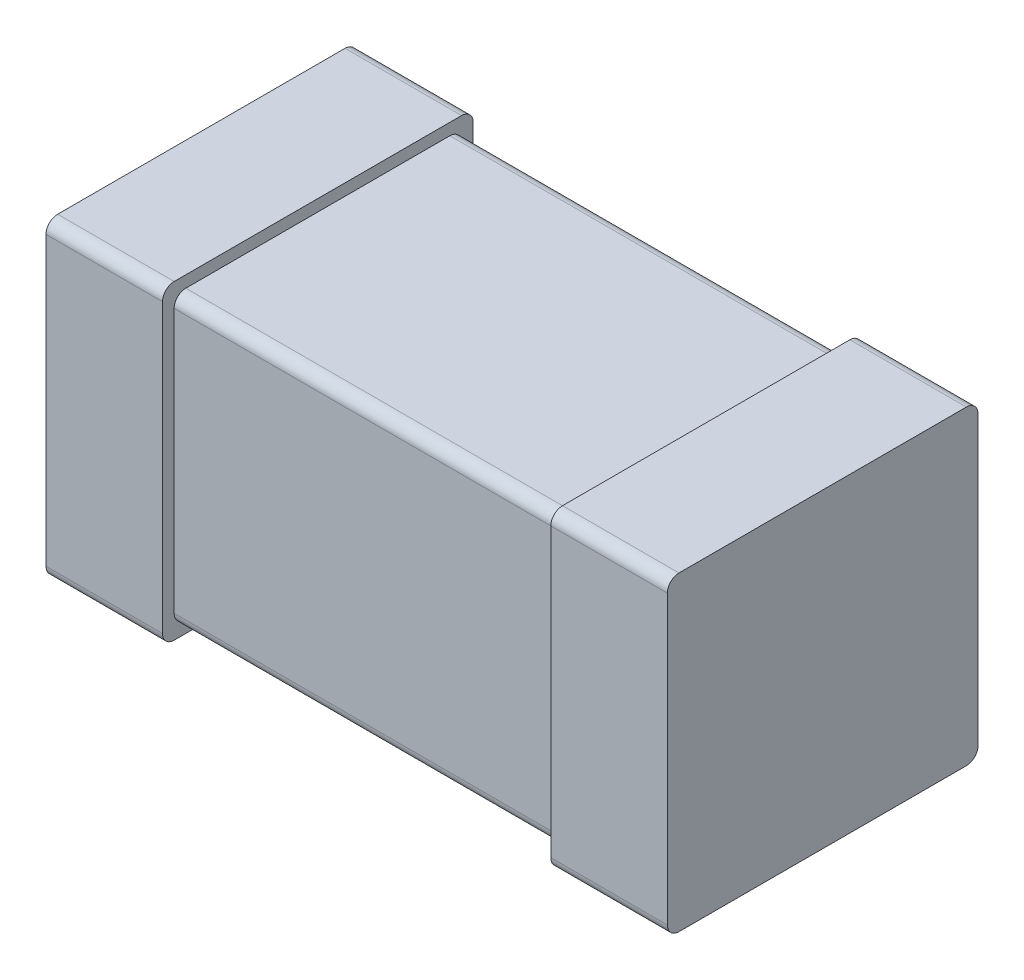
ISO-10303-21;
HEADER;
FILE_DESCRIPTION(('STEP AP214'),'2;1');
FILE_NAME('part.step','',(''),(''),'','','');
FILE_SCHEMA(('AUTOMOTIVE_DESIGN { 1 0 10303 214 1 1 1 1 }'));
ENDSEC;
DATA;
#1=APPLICATION_CONTEXT('core data for automotive mechanical design processes');
#2=APPLICATION_PROTOCOL_DEFINITION('international standard','automotive_design',2000,#1);
#3=PRODUCT_CONTEXT('',#1,'mechanical');
#4=PRODUCT('Part','Part','',(#3));
#5=PRODUCT_RELATED_PRODUCT_CATEGORY('part','',(#4));
#6=PRODUCT_DEFINITION_FORMATION('','',#4);
#7=PRODUCT_DEFINITION_CONTEXT('part definition',#1,'design');
#8=PRODUCT_DEFINITION('design','',#6,#7);
#9=PRODUCT_DEFINITION_SHAPE('','',#8);
#10=(LENGTH_UNIT() NAMED_UNIT(*) SI_UNIT(.MILLI.,.METRE.));
#11=(NAMED_UNIT(*) PLANE_ANGLE_UNIT() SI_UNIT($,.RADIAN.));
#12=(NAMED_UNIT(*) SI_UNIT($,.STERADIAN.) SOLID_ANGLE_UNIT());
#13=UNCERTAINTY_MEASURE_WITH_UNIT(LENGTH_MEASURE(1.E-05),#10,'distance_accuracy_value','');
#14=(GEOMETRIC_REPRESENTATION_CONTEXT(3) GLOBAL_UNCERTAINTY_ASSIGNED_CONTEXT((#13)) GLOBAL_UNIT_ASSIGNED_CONTEXT((#10,
#11,#12)) REPRESENTATION_CONTEXT('',''));
#15=CARTESIAN_POINT('',(0.,0.,0.));
#16=DIRECTION('',(0.,0.,1.));
#17=DIRECTION('',(1.,0.,0.));
#18=AXIS2_PLACEMENT_3D('',#15,#16,#17);
#19=CARTESIAN_POINT('',(194.464744279938,97.4790432923502,112.211582908599));
#20=DIRECTION('',(-1.,0.,0.));
#21=DIRECTION('',(0.,0.,1.));
#22=AXIS2_PLACEMENT_3D('',#19,#20,#21);
#23=PLANE('',#22);
#24=DIRECTION('',(0.,0.,1.));
#25=VECTOR('',#24,1.);
#26=CARTESIAN_POINT('',(194.464744279938,97.4790432923502,112.211582908599));
#27=LINE('',#26,#25);
#28=CARTESIAN_POINT('',(194.464744279938,97.4790432923502,112.241582908599));
#29=VERTEX_POINT('',#28);
#30=CARTESIAN_POINT('',(194.464744279938,97.4790432923502,112.981582908599));
#31=VERTEX_POINT('',#30);
#32=EDGE_CURVE('E67',#29,#31,#27,.T.);
#33=ORIENTED_EDGE('',*,*,#32,.F.);
#34=CARTESIAN_POINT('',(194.464744279938,97.4490432923502,112.241582908599));
#35=DIRECTION('',(-1.,0.,0.));
#36=DIRECTION('',(0.,0.,1.));
#37=AXIS2_PLACEMENT_3D('',#34,#35,#36);
#38=CIRCLE('',#37,0.0300000000000023);
#39=CARTESIAN_POINT('',(194.464744279938,97.4490432923502,112.211582908599));
#40=VERTEX_POINT('',#39);
#41=EDGE_CURVE('E11',#29,#40,#38,.T.);
#42=ORIENTED_EDGE('',*,*,#41,.T.);
#43=DIRECTION('',(0.,-1.,0.));
#44=VECTOR('',#43,1.);
#45=CARTESIAN_POINT('',(194.464744279938,97.4790432923502,112.211582908599));
#46=LINE('',#45,#44);
#47=CARTESIAN_POINT('',(194.464744279938,96.7090432923502,112.211582908599));
#48=VERTEX_POINT('',#47);
#49=EDGE_CURVE('E55',#40,#48,#46,.T.);
#50=ORIENTED_EDGE('',*,*,#49,.T.);
#51=CARTESIAN_POINT('',(194.464744279938,96.7090432923502,112.241582908599));
#52=DIRECTION('',(1.,0.,0.));
#53=DIRECTION('',(0.,0.,1.));
#54=AXIS2_PLACEMENT_3D('',#51,#52,#53);
#55=CIRCLE('',#54,0.0300000000000023);
#56=CARTESIAN_POINT('',(194.464744279938,96.6790432923502,112.241582908599));
#57=VERTEX_POINT('',#56);
#58=EDGE_CURVE('E277',#57,#48,#55,.T.);
#59=ORIENTED_EDGE('',*,*,#58,.F.);
#60=DIRECTION('',(0.,0.,1.));
#61=VECTOR('',#60,1.);
#62=CARTESIAN_POINT('',(194.464744279938,96.6790432923502,112.211582908599));
#63=LINE('',#62,#61);
#64=CARTESIAN_POINT('',(194.464744279938,96.6790432923502,112.981582908599));
#65=VERTEX_POINT('',#64);
#66=EDGE_CURVE('E272',#57,#65,#63,.T.);
#67=ORIENTED_EDGE('',*,*,#66,.T.);
#68=CARTESIAN_POINT('',(194.464744279938,96.7090432923502,112.981582908599));
#69=DIRECTION('',(-1.,0.,0.));
#70=DIRECTION('',(0.,0.,1.));
#71=AXIS2_PLACEMENT_3D('',#68,#69,#70);
#72=CIRCLE('',#71,0.0300000000000023);
#73=CARTESIAN_POINT('',(194.464744279938,96.7090432923502,113.011582908599));
#74=VERTEX_POINT('',#73);
#75=EDGE_CURVE('E262',#65,#74,#72,.T.);
#76=ORIENTED_EDGE('',*,*,#75,.T.);
#77=DIRECTION('',(0.,-1.,0.));
#78=VECTOR('',#77,1.);
#79=CARTESIAN_POINT('',(194.464744279938,97.4790432923502,113.011582908599));
#80=LINE('',#79,#78);
#81=CARTESIAN_POINT('',(194.464744279938,97.4490432923502,113.011582908599));
#82=VERTEX_POINT('',#81);
#83=EDGE_CURVE('E315',#82,#74,#80,.T.);
#84=ORIENTED_EDGE('',*,*,#83,.F.);
#85=CARTESIAN_POINT('',(194.464744279938,97.4490432923502,112.981582908599));
#86=DIRECTION('',(1.,0.,0.));
#87=DIRECTION('',(0.,0.,1.));
#88=AXIS2_PLACEMENT_3D('',#85,#86,#87);
#89=CIRCLE('',#88,0.0300000000000023);
#90=EDGE_CURVE('E343',#31,#82,#89,.T.);
#91=ORIENTED_EDGE('',*,*,#90,.F.);
#92=EDGE_LOOP('',(#33,#42,#50,#59,#67,#76,#84,#91));
#93=FACE_BOUND('',#92,.T.);
#94=ADVANCED_FACE('F44',(#93),#23,.T.);
#95=CARTESIAN_POINT('',(194.764744279938,96.6790432923502,112.211582908599));
#96=DIRECTION('',(0.,-1.,0.));
#97=DIRECTION('',(0.,0.,-1.));
#98=AXIS2_PLACEMENT_3D('',#95,#96,#97);
#99=PLANE('',#98);
#100=ORIENTED_EDGE('',*,*,#66,.F.);
#101=DIRECTION('',(-1.,0.,0.));
#102=VECTOR('',#101,1.);
#103=CARTESIAN_POINT('',(194.764744279938,96.6790432923502,112.241582908599));
#104=LINE('',#103,#102);
#105=CARTESIAN_POINT('',(194.764744279938,96.6790432923502,112.241582908599));
#106=VERTEX_POINT('',#105);
#107=EDGE_CURVE('E450',#106,#57,#104,.T.);
#108=ORIENTED_EDGE('',*,*,#107,.F.);
#109=DIRECTION('',(0.,0.,1.));
#110=VECTOR('',#109,1.);
#111=CARTESIAN_POINT('',(194.764744279938,96.6790432923502,112.211582908599));
#112=LINE('',#111,#110);
#113=CARTESIAN_POINT('',(194.764744279938,96.6790432923502,112.981582908599));
#114=VERTEX_POINT('',#113);
#115=EDGE_CURVE('E273',#106,#114,#112,.T.);
#116=ORIENTED_EDGE('',*,*,#115,.T.);
#117=DIRECTION('',(-1.,0.,0.));
#118=VECTOR('',#117,1.);
#119=CARTESIAN_POINT('',(194.764744279938,96.6790432923502,112.981582908599));
#120=LINE('',#119,#118);
#121=EDGE_CURVE('E267',#114,#65,#120,.T.);
#122=ORIENTED_EDGE('',*,*,#121,.T.);
#123=EDGE_LOOP('',(#100,#108,#116,#122));
#124=FACE_BOUND('',#123,.T.);
#125=ADVANCED_FACE('F283',(#124),#99,.T.);
#126=CARTESIAN_POINT('',(194.764744279938,96.7090432923502,112.981582908599));
#127=DIRECTION('',(-1.,0.,0.));
#128=DIRECTION('',(0.,-1.,0.));
#129=AXIS2_PLACEMENT_3D('',#126,#127,#128);
#130=CYLINDRICAL_SURFACE('',#129,0.0300000000000023);
#131=CARTESIAN_POINT('',(194.764744279938,96.7090432923502,112.981582908599));
#132=DIRECTION('',(-1.,0.,0.));
#133=DIRECTION('',(0.,0.,1.));
#134=AXIS2_PLACEMENT_3D('',#131,#132,#133);
#135=CIRCLE('',#134,0.0300000000000023);
#136=CARTESIAN_POINT('',(194.764744279938,96.7090432923502,113.011582908599));
#137=VERTEX_POINT('',#136);
#138=EDGE_CURVE('E287',#114,#137,#135,.T.);
#139=ORIENTED_EDGE('',*,*,#138,.T.);
#140=DIRECTION('',(-1.,0.,0.));
#141=VECTOR('',#140,1.);
#142=CARTESIAN_POINT('',(194.764744279938,96.7090432923502,113.011582908599));
#143=LINE('',#142,#141);
#144=EDGE_CURVE('E269',#137,#74,#143,.T.);
#145=ORIENTED_EDGE('',*,*,#144,.T.);
#146=ORIENTED_EDGE('',*,*,#75,.F.);
#147=ORIENTED_EDGE('',*,*,#121,.F.);
#148=EDGE_LOOP('',(#139,#145,#146,#147));
#149=FACE_BOUND('',#148,.T.);
#150=ADVANCED_FACE('F265',(#149),#130,.T.);
#151=CARTESIAN_POINT('',(194.764744279938,96.7090432923502,112.241582908599));
#152=DIRECTION('',(-1.,0.,0.));
#153=DIRECTION('',(0.,-1.,0.));
#154=AXIS2_PLACEMENT_3D('',#151,#152,#153);
#155=CYLINDRICAL_SURFACE('',#154,0.0300000000000023);
#156=ORIENTED_EDGE('',*,*,#107,.T.);
#157=ORIENTED_EDGE('',*,*,#58,.T.);
#158=DIRECTION('',(-1.,0.,0.));
#159=VECTOR('',#158,1.);
#160=CARTESIAN_POINT('',(194.764744279938,96.7090432923502,112.211582908599));
#161=LINE('',#160,#159);
#162=CARTESIAN_POINT('',(194.764744279938,96.7090432923502,112.211582908599));
#163=VERTEX_POINT('',#162);
#164=EDGE_CURVE('E495',#163,#48,#161,.T.);
#165=ORIENTED_EDGE('',*,*,#164,.F.);
#166=CARTESIAN_POINT('',(194.764744279938,96.7090432923502,112.241582908599));
#167=DIRECTION('',(1.,0.,0.));
#168=DIRECTION('',(0.,0.,1.));
#169=AXIS2_PLACEMENT_3D('',#166,#167,#168);
#170=CIRCLE('',#169,0.0300000000000023);
#171=EDGE_CURVE('E439',#106,#163,#170,.T.);
#172=ORIENTED_EDGE('',*,*,#171,.F.);
#173=EDGE_LOOP('',(#156,#157,#165,#172));
#174=FACE_BOUND('',#173,.T.);
#175=ADVANCED_FACE('F618',(#174),#155,.T.);
#176=CARTESIAN_POINT('',(194.764744279938,97.4790432923502,113.011582908599));
#177=DIRECTION('',(0.,0.,1.));
#178=DIRECTION('',(1.,0.,0.));
#179=AXIS2_PLACEMENT_3D('',#176,#177,#178);
#180=PLANE('',#179);
#181=DIRECTION('',(0.,-1.,0.));
#182=VECTOR('',#181,1.);
#183=CARTESIAN_POINT('',(194.764744279938,97.4790432923502,113.011582908599));
#184=LINE('',#183,#182);
#185=CARTESIAN_POINT('',(194.764744279938,97.4490432923502,113.011582908599));
#186=VERTEX_POINT('',#185);
#187=EDGE_CURVE('E372',#186,#137,#184,.T.);
#188=ORIENTED_EDGE('',*,*,#187,.F.);
#189=DIRECTION('',(-1.,0.,0.));
#190=VECTOR('',#189,1.);
#191=CARTESIAN_POINT('',(194.764744279938,97.4490432923502,113.011582908599));
#192=LINE('',#191,#190);
#193=EDGE_CURVE('E311',#186,#82,#192,.T.);
#194=ORIENTED_EDGE('',*,*,#193,.T.);
#195=ORIENTED_EDGE('',*,*,#83,.T.);
#196=ORIENTED_EDGE('',*,*,#144,.F.);
#197=EDGE_LOOP('',(#188,#194,#195,#196));
#198=FACE_BOUND('',#197,.T.);
#199=ADVANCED_FACE('F604',(#198),#180,.T.);
#200=CARTESIAN_POINT('',(194.764744279938,97.4790432923502,112.211582908599));
#201=DIRECTION('',(0.,0.,1.));
#202=DIRECTION('',(1.,0.,0.));
#203=AXIS2_PLACEMENT_3D('',#200,#201,#202);
#204=PLANE('',#203);
#205=ORIENTED_EDGE('',*,*,#164,.T.);
#206=ORIENTED_EDGE('',*,*,#49,.F.);
#207=DIRECTION('',(-1.,0.,0.));
#208=VECTOR('',#207,1.);
#209=CARTESIAN_POINT('',(194.764744279938,97.4490432923502,112.211582908599));
#210=LINE('',#209,#208);
#211=CARTESIAN_POINT('',(194.764744279938,97.4490432923502,112.211582908599));
#212=VERTEX_POINT('',#211);
#213=EDGE_CURVE('E298',#212,#40,#210,.T.);
#214=ORIENTED_EDGE('',*,*,#213,.F.);
#215=DIRECTION('',(0.,-1.,0.));
#216=VECTOR('',#215,1.);
#217=CARTESIAN_POINT('',(194.764744279938,97.4790432923502,112.211582908599));
#218=LINE('',#217,#216);
#219=EDGE_CURVE('E483',#212,#163,#218,.T.);
#220=ORIENTED_EDGE('',*,*,#219,.T.);
#221=EDGE_LOOP('',(#205,#206,#214,#220));
#222=FACE_BOUND('',#221,.T.);
#223=ADVANCED_FACE('F600',(#222),#204,.F.);
#224=CARTESIAN_POINT('',(194.764744279938,97.4490432923502,112.981582908599));
#225=DIRECTION('',(-1.,0.,0.));
#226=DIRECTION('',(0.,1.,0.));
#227=AXIS2_PLACEMENT_3D('',#224,#225,#226);
#228=CYLINDRICAL_SURFACE('',#227,0.0300000000000023);
#229=DIRECTION('',(-1.,0.,0.));
#230=VECTOR('',#229,1.);
#231=CARTESIAN_POINT('',(194.764744279938,97.4790432923502,112.981582908599));
#232=LINE('',#231,#230);
#233=CARTESIAN_POINT('',(194.764744279938,97.4790432923502,112.981582908599));
#234=VERTEX_POINT('',#233);
#235=EDGE_CURVE('E345',#234,#31,#232,.T.);
#236=ORIENTED_EDGE('',*,*,#235,.T.);
#237=ORIENTED_EDGE('',*,*,#90,.T.);
#238=ORIENTED_EDGE('',*,*,#193,.F.);
#239=CARTESIAN_POINT('',(194.764744279938,97.4490432923502,112.981582908599));
#240=DIRECTION('',(1.,0.,0.));
#241=DIRECTION('',(0.,0.,1.));
#242=AXIS2_PLACEMENT_3D('',#239,#240,#241);
#243=CIRCLE('',#242,0.0300000000000023);
#244=EDGE_CURVE('E368',#234,#186,#243,.T.);
#245=ORIENTED_EDGE('',*,*,#244,.F.);
#246=EDGE_LOOP('',(#236,#237,#238,#245));
#247=FACE_BOUND('',#246,.T.);
#248=ADVANCED_FACE('F596',(#247),#228,.T.);
#249=CARTESIAN_POINT('',(194.764744279938,97.4490432923502,112.241582908599));
#250=DIRECTION('',(-1.,0.,0.));
#251=DIRECTION('',(0.,1.,0.));
#252=AXIS2_PLACEMENT_3D('',#249,#250,#251);
#253=CYLINDRICAL_SURFACE('',#252,0.0300000000000023);
#254=CARTESIAN_POINT('',(194.764744279938,97.4490432923502,112.241582908599));
#255=DIRECTION('',(-1.,0.,0.));
#256=DIRECTION('',(0.,0.,1.));
#257=AXIS2_PLACEMENT_3D('',#254,#255,#256);
#258=CIRCLE('',#257,0.0300000000000023);
#259=CARTESIAN_POINT('',(194.764744279938,97.4790432923502,112.241582908599));
#260=VERTEX_POINT('',#259);
#261=EDGE_CURVE('E346',#260,#212,#258,.T.);
#262=ORIENTED_EDGE('',*,*,#261,.T.);
#263=ORIENTED_EDGE('',*,*,#213,.T.);
#264=ORIENTED_EDGE('',*,*,#41,.F.);
#265=DIRECTION('',(-1.,0.,0.));
#266=VECTOR('',#265,1.);
#267=CARTESIAN_POINT('',(194.764744279938,97.4790432923502,112.241582908599));
#268=LINE('',#267,#266);
#269=EDGE_CURVE('E331',#260,#29,#268,.T.);
#270=ORIENTED_EDGE('',*,*,#269,.F.);
#271=EDGE_LOOP('',(#262,#263,#264,#270));
#272=FACE_BOUND('',#271,.T.);
#273=ADVANCED_FACE('F599',(#272),#253,.T.);
#274=CARTESIAN_POINT('',(194.764744279938,97.4790432923502,112.211582908599));
#275=DIRECTION('',(0.,-1.,0.));
#276=DIRECTION('',(0.,0.,-1.));
#277=AXIS2_PLACEMENT_3D('',#274,#275,#276);
#278=PLANE('',#277);
#279=ORIENTED_EDGE('',*,*,#235,.F.);
#280=DIRECTION('',(0.,0.,1.));
#281=VECTOR('',#280,1.);
#282=CARTESIAN_POINT('',(194.764744279938,97.4790432923502,112.211582908599));
#283=LINE('',#282,#281);
#284=EDGE_CURVE('E383',#260,#234,#283,.T.);
#285=ORIENTED_EDGE('',*,*,#284,.F.);
#286=ORIENTED_EDGE('',*,*,#269,.T.);
#287=ORIENTED_EDGE('',*,*,#32,.T.);
#288=EDGE_LOOP('',(#279,#285,#286,#287));
#289=FACE_BOUND('',#288,.T.);
#290=ADVANCED_FACE('F611',(#289),#278,.F.);
#291=CARTESIAN_POINT('',(194.764744279938,97.4790432923502,112.211582908599));
#292=DIRECTION('',(-1.,0.,0.));
#293=DIRECTION('',(0.,0.,1.));
#294=AXIS2_PLACEMENT_3D('',#291,#292,#293);
#295=PLANE('',#294);
#296=ORIENTED_EDGE('',*,*,#244,.T.);
#297=ORIENTED_EDGE('',*,*,#187,.T.);
#298=ORIENTED_EDGE('',*,*,#138,.F.);
#299=ORIENTED_EDGE('',*,*,#115,.F.);
#300=ORIENTED_EDGE('',*,*,#171,.T.);
#301=ORIENTED_EDGE('',*,*,#219,.F.);
#302=ORIENTED_EDGE('',*,*,#261,.F.);
#303=ORIENTED_EDGE('',*,*,#284,.T.);
#304=EDGE_LOOP('',(#296,#297,#298,#299,#300,#301,#302,#303));
#305=FACE_BOUND('',#304,.T.);
#306=DIRECTION('',(0.,-1.,0.));
#307=VECTOR('',#306,1.);
#308=CARTESIAN_POINT('',(194.764744279938,97.4490432923502,112.241582908599));
#309=LINE('',#308,#307);
#310=CARTESIAN_POINT('',(194.764744279938,97.4190432923502,112.241582908599));
#311=VERTEX_POINT('',#310);
#312=CARTESIAN_POINT('',(194.764744279938,96.7390432923502,112.241582908599));
#313=VERTEX_POINT('',#312);
#314=EDGE_CURVE('E379',#311,#313,#309,.T.);
#315=ORIENTED_EDGE('',*,*,#314,.T.);
#316=CARTESIAN_POINT('',(194.764744279938,96.7390432923502,112.271582908599));
#317=DIRECTION('',(1.,0.,0.));
#318=DIRECTION('',(0.,0.,1.));
#319=AXIS2_PLACEMENT_3D('',#316,#317,#318);
#320=CIRCLE('',#319,0.0300000000000023);
#321=CARTESIAN_POINT('',(194.764744279938,96.7090432923502,112.271582908599));
#322=VERTEX_POINT('',#321);
#323=EDGE_CURVE('E321',#322,#313,#320,.T.);
#324=ORIENTED_EDGE('',*,*,#323,.F.);
#325=DIRECTION('',(0.,0.,1.));
#326=VECTOR('',#325,1.);
#327=CARTESIAN_POINT('',(194.764744279938,96.7090432923502,112.241582908599));
#328=LINE('',#327,#326);
#329=CARTESIAN_POINT('',(194.764744279938,96.7090432923502,112.951582908599));
#330=VERTEX_POINT('',#329);
#331=EDGE_CURVE('E384',#322,#330,#328,.T.);
#332=ORIENTED_EDGE('',*,*,#331,.T.);
#333=CARTESIAN_POINT('',(194.764744279938,96.7390432923502,112.951582908599));
#334=DIRECTION('',(-1.,0.,0.));
#335=DIRECTION('',(0.,0.,1.));
#336=AXIS2_PLACEMENT_3D('',#333,#334,#335);
#337=CIRCLE('',#336,0.0300000000000023);
#338=CARTESIAN_POINT('',(194.764744279938,96.7390432923502,112.981582908599));
#339=VERTEX_POINT('',#338);
#340=EDGE_CURVE('E411',#330,#339,#337,.T.);
#341=ORIENTED_EDGE('',*,*,#340,.T.);
#342=DIRECTION('',(0.,-1.,0.));
#343=VECTOR('',#342,1.);
#344=CARTESIAN_POINT('',(194.764744279938,97.4490432923502,112.981582908599));
#345=LINE('',#344,#343);
#346=CARTESIAN_POINT('',(194.764744279938,97.4190432923502,112.981582908599));
#347=VERTEX_POINT('',#346);
#348=EDGE_CURVE('E464',#347,#339,#345,.T.);
#349=ORIENTED_EDGE('',*,*,#348,.F.);
#350=CARTESIAN_POINT('',(194.764744279938,97.4190432923502,112.951582908599));
#351=DIRECTION('',(1.,0.,0.));
#352=DIRECTION('',(0.,0.,1.));
#353=AXIS2_PLACEMENT_3D('',#350,#351,#352);
#354=CIRCLE('',#353,0.0300000000000023);
#355=CARTESIAN_POINT('',(194.764744279938,97.4490432923502,112.951582908599));
#356=VERTEX_POINT('',#355);
#357=EDGE_CURVE('E385',#356,#347,#354,.T.);
#358=ORIENTED_EDGE('',*,*,#357,.F.);
#359=DIRECTION('',(0.,0.,1.));
#360=VECTOR('',#359,1.);
#361=CARTESIAN_POINT('',(194.764744279938,97.4490432923502,112.241582908599));
#362=LINE('',#361,#360);
#363=CARTESIAN_POINT('',(194.764744279938,97.4490432923502,112.271582908599));
#364=VERTEX_POINT('',#363);
#365=EDGE_CURVE('E420',#364,#356,#362,.T.);
#366=ORIENTED_EDGE('',*,*,#365,.F.);
#367=CARTESIAN_POINT('',(194.764744279938,97.4190432923502,112.271582908599));
#368=DIRECTION('',(-1.,0.,0.));
#369=DIRECTION('',(0.,0.,1.));
#370=AXIS2_PLACEMENT_3D('',#367,#368,#369);
#371=CIRCLE('',#370,0.0300000000000023);
#372=EDGE_CURVE('E429',#364,#311,#371,.T.);
#373=ORIENTED_EDGE('',*,*,#372,.T.);
#374=EDGE_LOOP('',(#315,#324,#332,#341,#349,#358,#366,#373));
#375=FACE_BOUND('',#374,.T.);
#376=ADVANCED_FACE('F608',(#305,#375),#295,.F.);
#377=CARTESIAN_POINT('',(195.764744279938,97.4490432923502,112.241582908599));
#378=DIRECTION('',(0.,-1.,0.));
#379=DIRECTION('',(0.,0.,-1.));
#380=AXIS2_PLACEMENT_3D('',#377,#378,#379);
#381=PLANE('',#380);
#382=DIRECTION('',(-1.,0.,0.));
#383=VECTOR('',#382,1.);
#384=CARTESIAN_POINT('',(195.764744279938,97.4490432923502,112.951582908599));
#385=LINE('',#384,#383);
#386=CARTESIAN_POINT('',(195.764744279938,97.4490432923502,112.951582908599));
#387=VERTEX_POINT('',#386);
#388=EDGE_CURVE('E388',#387,#356,#385,.T.);
#389=ORIENTED_EDGE('',*,*,#388,.F.);
#390=DIRECTION('',(0.,0.,1.));
#391=VECTOR('',#390,1.);
#392=CARTESIAN_POINT('',(195.764744279938,97.4490432923502,112.241582908599));
#393=LINE('',#392,#391);
#394=CARTESIAN_POINT('',(195.764744279938,97.4490432923502,112.271582908599));
#395=VERTEX_POINT('',#394);
#396=EDGE_CURVE('E421',#395,#387,#393,.T.);
#397=ORIENTED_EDGE('',*,*,#396,.F.);
#398=DIRECTION('',(-1.,0.,0.));
#399=VECTOR('',#398,1.);
#400=CARTESIAN_POINT('',(195.764744279938,97.4490432923502,112.271582908599));
#401=LINE('',#400,#399);
#402=EDGE_CURVE('E428',#395,#364,#401,.T.);
#403=ORIENTED_EDGE('',*,*,#402,.T.);
#404=ORIENTED_EDGE('',*,*,#365,.T.);
#405=EDGE_LOOP('',(#389,#397,#403,#404));
#406=FACE_BOUND('',#405,.T.);
#407=ADVANCED_FACE('F605',(#406),#381,.F.);
#408=CARTESIAN_POINT('',(195.764744279938,97.4190432923502,112.951582908599));
#409=DIRECTION('',(-1.,0.,0.));
#410=DIRECTION('',(0.,1.,0.));
#411=AXIS2_PLACEMENT_3D('',#408,#409,#410);
#412=CYLINDRICAL_SURFACE('',#411,0.0300000000000023);
#413=ORIENTED_EDGE('',*,*,#388,.T.);
#414=ORIENTED_EDGE('',*,*,#357,.T.);
#415=DIRECTION('',(-1.,0.,0.));
#416=VECTOR('',#415,1.);
#417=CARTESIAN_POINT('',(195.764744279938,97.4190432923502,112.981582908599));
#418=LINE('',#417,#416);
#419=CARTESIAN_POINT('',(195.764744279938,97.4190432923502,112.981582908599));
#420=VERTEX_POINT('',#419);
#421=EDGE_CURVE('E389',#420,#347,#418,.T.);
#422=ORIENTED_EDGE('',*,*,#421,.F.);
#423=CARTESIAN_POINT('',(195.764744279938,97.4190432923502,112.951582908599));
#424=DIRECTION('',(1.,0.,0.));
#425=DIRECTION('',(0.,0.,1.));
#426=AXIS2_PLACEMENT_3D('',#423,#424,#425);
#427=CIRCLE('',#426,0.0300000000000023);
#428=EDGE_CURVE('E424',#387,#420,#427,.T.);
#429=ORIENTED_EDGE('',*,*,#428,.F.);
#430=EDGE_LOOP('',(#413,#414,#422,#429));
#431=FACE_BOUND('',#430,.T.);
#432=ADVANCED_FACE('F587',(#431),#412,.T.);
#433=CARTESIAN_POINT('',(195.764744279938,97.4490432923502,112.981582908599));
#434=DIRECTION('',(0.,0.,1.));
#435=DIRECTION('',(1.,0.,0.));
#436=AXIS2_PLACEMENT_3D('',#433,#434,#435);
#437=PLANE('',#436);
#438=DIRECTION('',(0.,-1.,0.));
#439=VECTOR('',#438,1.);
#440=CARTESIAN_POINT('',(195.764744279938,97.4490432923502,112.981582908599));
#441=LINE('',#440,#439);
#442=CARTESIAN_POINT('',(195.764744279938,96.7390432923502,112.981582908599));
#443=VERTEX_POINT('',#442);
#444=EDGE_CURVE('E319',#420,#443,#441,.T.);
#445=ORIENTED_EDGE('',*,*,#444,.F.);
#446=ORIENTED_EDGE('',*,*,#421,.T.);
#447=ORIENTED_EDGE('',*,*,#348,.T.);
#448=DIRECTION('',(-1.,0.,0.));
#449=VECTOR('',#448,1.);
#450=CARTESIAN_POINT('',(195.764744279938,96.7390432923502,112.981582908599));
#451=LINE('',#450,#449);
#452=EDGE_CURVE('E407',#443,#339,#451,.T.);
#453=ORIENTED_EDGE('',*,*,#452,.F.);
#454=EDGE_LOOP('',(#445,#446,#447,#453));
#455=FACE_BOUND('',#454,.T.);
#456=ADVANCED_FACE('F584',(#455),#437,.T.);
#457=CARTESIAN_POINT('',(195.764744279938,96.7390432923502,112.951582908599));
#458=DIRECTION('',(-1.,0.,0.));
#459=DIRECTION('',(0.,-1.,0.));
#460=AXIS2_PLACEMENT_3D('',#457,#458,#459);
#461=CYLINDRICAL_SURFACE('',#460,0.0300000000000023);
#462=CARTESIAN_POINT('',(195.764744279938,96.7390432923502,112.951582908599));
#463=DIRECTION('',(-1.,0.,0.));
#464=DIRECTION('',(0.,0.,1.));
#465=AXIS2_PLACEMENT_3D('',#462,#463,#464);
#466=CIRCLE('',#465,0.0300000000000023);
#467=CARTESIAN_POINT('',(195.764744279938,96.7090432923502,112.951582908599));
#468=VERTEX_POINT('',#467);
#469=EDGE_CURVE('E487',#468,#443,#466,.T.);
#470=ORIENTED_EDGE('',*,*,#469,.T.);
#471=ORIENTED_EDGE('',*,*,#452,.T.);
#472=ORIENTED_EDGE('',*,*,#340,.F.);
#473=DIRECTION('',(-1.,0.,0.));
#474=VECTOR('',#473,1.);
#475=CARTESIAN_POINT('',(195.764744279938,96.7090432923502,112.951582908599));
#476=LINE('',#475,#474);
#477=EDGE_CURVE('E48',#468,#330,#476,.T.);
#478=ORIENTED_EDGE('',*,*,#477,.F.);
#479=EDGE_LOOP('',(#470,#471,#472,#478));
#480=FACE_BOUND('',#479,.T.);
#481=ADVANCED_FACE('F582',(#480),#461,.T.);
#482=CARTESIAN_POINT('',(195.764744279938,96.7090432923502,112.241582908599));
#483=DIRECTION('',(0.,-1.,0.));
#484=DIRECTION('',(0.,0.,-1.));
#485=AXIS2_PLACEMENT_3D('',#482,#483,#484);
#486=PLANE('',#485);
#487=ORIENTED_EDGE('',*,*,#331,.F.);
#488=DIRECTION('',(-1.,0.,0.));
#489=VECTOR('',#488,1.);
#490=CARTESIAN_POINT('',(195.764744279938,96.7090432923502,112.271582908599));
#491=LINE('',#490,#489);
#492=CARTESIAN_POINT('',(195.764744279938,96.7090432923502,112.271582908599));
#493=VERTEX_POINT('',#492);
#494=EDGE_CURVE('E324',#493,#322,#491,.T.);
#495=ORIENTED_EDGE('',*,*,#494,.F.);
#496=DIRECTION('',(0.,0.,1.));
#497=VECTOR('',#496,1.);
#498=CARTESIAN_POINT('',(195.764744279938,96.7090432923502,112.241582908599));
#499=LINE('',#498,#497);
#500=EDGE_CURVE('E433',#493,#468,#499,.T.);
#501=ORIENTED_EDGE('',*,*,#500,.T.);
#502=ORIENTED_EDGE('',*,*,#477,.T.);
#503=EDGE_LOOP('',(#487,#495,#501,#502));
#504=FACE_BOUND('',#503,.T.);
#505=ADVANCED_FACE('F589',(#504),#486,.T.);
#506=CARTESIAN_POINT('',(195.764744279938,96.7390432923502,112.271582908599));
#507=DIRECTION('',(-1.,0.,0.));
#508=DIRECTION('',(0.,-1.,0.));
#509=AXIS2_PLACEMENT_3D('',#506,#507,#508);
#510=CYLINDRICAL_SURFACE('',#509,0.0300000000000023);
#511=ORIENTED_EDGE('',*,*,#494,.T.);
#512=ORIENTED_EDGE('',*,*,#323,.T.);
#513=DIRECTION('',(-1.,0.,0.));
#514=VECTOR('',#513,1.);
#515=CARTESIAN_POINT('',(195.764744279938,96.7390432923502,112.241582908599));
#516=LINE('',#515,#514);
#517=CARTESIAN_POINT('',(195.764744279938,96.7390432923502,112.241582908599));
#518=VERTEX_POINT('',#517);
#519=EDGE_CURVE('E325',#518,#313,#516,.T.);
#520=ORIENTED_EDGE('',*,*,#519,.F.);
#521=CARTESIAN_POINT('',(195.764744279938,96.7390432923502,112.271582908599));
#522=DIRECTION('',(1.,0.,0.));
#523=DIRECTION('',(0.,0.,1.));
#524=AXIS2_PLACEMENT_3D('',#521,#522,#523);
#525=CIRCLE('',#524,0.0300000000000023);
#526=EDGE_CURVE('E316',#493,#518,#525,.T.);
#527=ORIENTED_EDGE('',*,*,#526,.F.);
#528=EDGE_LOOP('',(#511,#512,#520,#527));
#529=FACE_BOUND('',#528,.T.);
#530=ADVANCED_FACE('F592',(#529),#510,.T.);
#531=CARTESIAN_POINT('',(195.764744279938,97.4490432923502,112.241582908599));
#532=DIRECTION('',(0.,0.,1.));
#533=DIRECTION('',(1.,0.,0.));
#534=AXIS2_PLACEMENT_3D('',#531,#532,#533);
#535=PLANE('',#534);
#536=ORIENTED_EDGE('',*,*,#519,.T.);
#537=ORIENTED_EDGE('',*,*,#314,.F.);
#538=DIRECTION('',(-1.,0.,0.));
#539=VECTOR('',#538,1.);
#540=CARTESIAN_POINT('',(195.764744279938,97.4190432923502,112.241582908599));
#541=LINE('',#540,#539);
#542=CARTESIAN_POINT('',(195.764744279938,97.4190432923502,112.241582908599));
#543=VERTEX_POINT('',#542);
#544=EDGE_CURVE('E204',#543,#311,#541,.T.);
#545=ORIENTED_EDGE('',*,*,#544,.F.);
#546=DIRECTION('',(0.,-1.,0.));
#547=VECTOR('',#546,1.);
#548=CARTESIAN_POINT('',(195.764744279938,97.4490432923502,112.241582908599));
#549=LINE('',#548,#547);
#550=EDGE_CURVE('E412',#543,#518,#549,.T.);
#551=ORIENTED_EDGE('',*,*,#550,.T.);
#552=EDGE_LOOP('',(#536,#537,#545,#551));
#553=FACE_BOUND('',#552,.T.);
#554=ADVANCED_FACE('F622',(#553),#535,.F.);
#555=CARTESIAN_POINT('',(195.764744279938,97.4190432923502,112.271582908599));
#556=DIRECTION('',(-1.,0.,0.));
#557=DIRECTION('',(0.,1.,0.));
#558=AXIS2_PLACEMENT_3D('',#555,#556,#557);
#559=CYLINDRICAL_SURFACE('',#558,0.0300000000000023);
#560=CARTESIAN_POINT('',(195.764744279938,97.4190432923502,112.271582908599));
#561=DIRECTION('',(-1.,0.,0.));
#562=DIRECTION('',(0.,0.,1.));
#563=AXIS2_PLACEMENT_3D('',#560,#561,#562);
#564=CIRCLE('',#563,0.0300000000000023);
#565=EDGE_CURVE('E366',#395,#543,#564,.T.);
#566=ORIENTED_EDGE('',*,*,#565,.T.);
#567=ORIENTED_EDGE('',*,*,#544,.T.);
#568=ORIENTED_EDGE('',*,*,#372,.F.);
#569=ORIENTED_EDGE('',*,*,#402,.F.);
#570=EDGE_LOOP('',(#566,#567,#568,#569));
#571=FACE_BOUND('',#570,.T.);
#572=ADVANCED_FACE('F630',(#571),#559,.T.);
#573=CARTESIAN_POINT('',(195.764744279938,97.4790432923502,112.211582908599));
#574=DIRECTION('',(-1.,0.,0.));
#575=DIRECTION('',(0.,0.,1.));
#576=AXIS2_PLACEMENT_3D('',#573,#574,#575);
#577=PLANE('',#576);
#578=DIRECTION('',(0.,0.,1.));
#579=VECTOR('',#578,1.);
#580=CARTESIAN_POINT('',(195.764744279938,97.4790432923502,112.211582908599));
#581=LINE('',#580,#579);
#582=CARTESIAN_POINT('',(195.764744279938,97.4790432923502,112.241582908599));
#583=VERTEX_POINT('',#582);
#584=CARTESIAN_POINT('',(195.764744279938,97.4790432923502,112.981582908599));
#585=VERTEX_POINT('',#584);
#586=EDGE_CURVE('E219',#583,#585,#581,.T.);
#587=ORIENTED_EDGE('',*,*,#586,.F.);
#588=CARTESIAN_POINT('',(195.764744279938,97.4490432923502,112.241582908599));
#589=DIRECTION('',(-1.,0.,0.));
#590=DIRECTION('',(0.,0.,1.));
#591=AXIS2_PLACEMENT_3D('',#588,#589,#590);
#592=CIRCLE('',#591,0.0300000000000023);
#593=CARTESIAN_POINT('',(195.764744279938,97.4490432923502,112.211582908599));
#594=VERTEX_POINT('',#593);
#595=EDGE_CURVE('E367',#583,#594,#592,.T.);
#596=ORIENTED_EDGE('',*,*,#595,.T.);
#597=DIRECTION('',(0.,-1.,0.));
#598=VECTOR('',#597,1.);
#599=CARTESIAN_POINT('',(195.764744279938,97.4790432923502,112.211582908599));
#600=LINE('',#599,#598);
#601=CARTESIAN_POINT('',(195.764744279938,96.7090432923502,112.211582908599));
#602=VERTEX_POINT('',#601);
#603=EDGE_CURVE('E309',#594,#602,#600,.T.);
#604=ORIENTED_EDGE('',*,*,#603,.T.);
#605=CARTESIAN_POINT('',(195.764744279938,96.7090432923502,112.241582908599));
#606=DIRECTION('',(1.,0.,0.));
#607=DIRECTION('',(0.,0.,1.));
#608=AXIS2_PLACEMENT_3D('',#605,#606,#607);
#609=CIRCLE('',#608,0.0300000000000023);
#610=CARTESIAN_POINT('',(195.764744279938,96.6790432923502,112.241582908599));
#611=VERTEX_POINT('',#610);
#612=EDGE_CURVE('E303',#611,#602,#609,.T.);
#613=ORIENTED_EDGE('',*,*,#612,.F.);
#614=DIRECTION('',(0.,0.,1.));
#615=VECTOR('',#614,1.);
#616=CARTESIAN_POINT('',(195.764744279938,96.6790432923502,112.211582908599));
#617=LINE('',#616,#615);
#618=CARTESIAN_POINT('',(195.764744279938,96.6790432923502,112.981582908599));
#619=VERTEX_POINT('',#618);
#620=EDGE_CURVE('E305',#611,#619,#617,.T.);
#621=ORIENTED_EDGE('',*,*,#620,.T.);
#622=CARTESIAN_POINT('',(195.764744279938,96.7090432923502,112.981582908599));
#623=DIRECTION('',(-1.,0.,0.));
#624=DIRECTION('',(0.,0.,1.));
#625=AXIS2_PLACEMENT_3D('',#622,#623,#624);
#626=CIRCLE('',#625,0.0300000000000023);
#627=CARTESIAN_POINT('',(195.764744279938,96.7090432923502,113.011582908599));
#628=VERTEX_POINT('',#627);
#629=EDGE_CURVE('E310',#619,#628,#626,.T.);
#630=ORIENTED_EDGE('',*,*,#629,.T.);
#631=DIRECTION('',(0.,-1.,0.));
#632=VECTOR('',#631,1.);
#633=CARTESIAN_POINT('',(195.764744279938,97.4790432923502,113.011582908599));
#634=LINE('',#633,#632);
#635=CARTESIAN_POINT('',(195.764744279938,97.4490432923502,113.011582908599));
#636=VERTEX_POINT('',#635);
#637=EDGE_CURVE('E304',#636,#628,#634,.T.);
#638=ORIENTED_EDGE('',*,*,#637,.F.);
#639=CARTESIAN_POINT('',(195.764744279938,97.4490432923502,112.981582908599));
#640=DIRECTION('',(1.,0.,0.));
#641=DIRECTION('',(0.,0.,1.));
#642=AXIS2_PLACEMENT_3D('',#639,#640,#641);
#643=CIRCLE('',#642,0.0300000000000023);
#644=EDGE_CURVE('E348',#585,#636,#643,.T.);
#645=ORIENTED_EDGE('',*,*,#644,.F.);
#646=EDGE_LOOP('',(#587,#596,#604,#613,#621,#630,#638,#645));
#647=FACE_BOUND('',#646,.T.);
#648=ORIENTED_EDGE('',*,*,#565,.F.);
#649=ORIENTED_EDGE('',*,*,#396,.T.);
#650=ORIENTED_EDGE('',*,*,#428,.T.);
#651=ORIENTED_EDGE('',*,*,#444,.T.);
#652=ORIENTED_EDGE('',*,*,#469,.F.);
#653=ORIENTED_EDGE('',*,*,#500,.F.);
#654=ORIENTED_EDGE('',*,*,#526,.T.);
#655=ORIENTED_EDGE('',*,*,#550,.F.);
#656=EDGE_LOOP('',(#648,#649,#650,#651,#652,#653,#654,#655));
#657=FACE_BOUND('',#656,.T.);
#658=ADVANCED_FACE('F539',(#647,#657),#577,.T.);
#659=CARTESIAN_POINT('',(196.064744279938,96.6790432923502,112.211582908599));
#660=DIRECTION('',(0.,-1.,0.));
#661=DIRECTION('',(0.,0.,-1.));
#662=AXIS2_PLACEMENT_3D('',#659,#660,#661);
#663=PLANE('',#662);
#664=ORIENTED_EDGE('',*,*,#620,.F.);
#665=DIRECTION('',(-1.,0.,0.));
#666=VECTOR('',#665,1.);
#667=CARTESIAN_POINT('',(196.064744279938,96.6790432923502,112.241582908599));
#668=LINE('',#667,#666);
#669=CARTESIAN_POINT('',(196.064744279938,96.6790432923502,112.241582908599));
#670=VERTEX_POINT('',#669);
#671=EDGE_CURVE('E454',#670,#611,#668,.T.);
#672=ORIENTED_EDGE('',*,*,#671,.F.);
#673=DIRECTION('',(0.,0.,1.));
#674=VECTOR('',#673,1.);
#675=CARTESIAN_POINT('',(196.064744279938,96.6790432923502,112.211582908599));
#676=LINE('',#675,#674);
#677=CARTESIAN_POINT('',(196.064744279938,96.6790432923502,112.981582908599));
#678=VERTEX_POINT('',#677);
#679=EDGE_CURVE('E320',#670,#678,#676,.T.);
#680=ORIENTED_EDGE('',*,*,#679,.T.);
#681=DIRECTION('',(-1.,0.,0.));
#682=VECTOR('',#681,1.);
#683=CARTESIAN_POINT('',(196.064744279938,96.6790432923502,112.981582908599));
#684=LINE('',#683,#682);
#685=EDGE_CURVE('E377',#678,#619,#684,.T.);
#686=ORIENTED_EDGE('',*,*,#685,.T.);
#687=EDGE_LOOP('',(#664,#672,#680,#686));
#688=FACE_BOUND('',#687,.T.);
#689=ADVANCED_FACE('F533',(#688),#663,.T.);
#690=CARTESIAN_POINT('',(196.064744279938,96.7090432923502,112.981582908599));
#691=DIRECTION('',(-1.,0.,0.));
#692=DIRECTION('',(0.,-1.,0.));
#693=AXIS2_PLACEMENT_3D('',#690,#691,#692);
#694=CYLINDRICAL_SURFACE('',#693,0.0300000000000023);
#695=CARTESIAN_POINT('',(196.064744279938,96.7090432923502,112.981582908599));
#696=DIRECTION('',(-1.,0.,0.));
#697=DIRECTION('',(0.,0.,1.));
#698=AXIS2_PLACEMENT_3D('',#695,#696,#697);
#699=CIRCLE('',#698,0.0300000000000023);
#700=CARTESIAN_POINT('',(196.064744279938,96.7090432923502,113.011582908599));
#701=VERTEX_POINT('',#700);
#702=EDGE_CURVE('E373',#678,#701,#699,.T.);
#703=ORIENTED_EDGE('',*,*,#702,.T.);
#704=DIRECTION('',(-1.,0.,0.));
#705=VECTOR('',#704,1.);
#706=CARTESIAN_POINT('',(196.064744279938,96.7090432923502,113.011582908599));
#707=LINE('',#706,#705);
#708=EDGE_CURVE('E378',#701,#628,#707,.T.);
#709=ORIENTED_EDGE('',*,*,#708,.T.);
#710=ORIENTED_EDGE('',*,*,#629,.F.);
#711=ORIENTED_EDGE('',*,*,#685,.F.);
#712=EDGE_LOOP('',(#703,#709,#710,#711));
#713=FACE_BOUND('',#712,.T.);
#714=ADVANCED_FACE('F537',(#713),#694,.T.);
#715=CARTESIAN_POINT('',(196.064744279938,96.7090432923502,112.241582908599));
#716=DIRECTION('',(-1.,0.,0.));
#717=DIRECTION('',(0.,-1.,0.));
#718=AXIS2_PLACEMENT_3D('',#715,#716,#717);
#719=CYLINDRICAL_SURFACE('',#718,0.0300000000000023);
#720=ORIENTED_EDGE('',*,*,#671,.T.);
#721=ORIENTED_EDGE('',*,*,#612,.T.);
#722=DIRECTION('',(-1.,0.,0.));
#723=VECTOR('',#722,1.);
#724=CARTESIAN_POINT('',(196.064744279938,96.7090432923502,112.211582908599));
#725=LINE('',#724,#723);
#726=CARTESIAN_POINT('',(196.064744279938,96.7090432923502,112.211582908599));
#727=VERTEX_POINT('',#726);
#728=EDGE_CURVE('E515',#727,#602,#725,.T.);
#729=ORIENTED_EDGE('',*,*,#728,.F.);
#730=CARTESIAN_POINT('',(196.064744279938,96.7090432923502,112.241582908599));
#731=DIRECTION('',(1.,0.,0.));
#732=DIRECTION('',(0.,0.,1.));
#733=AXIS2_PLACEMENT_3D('',#730,#731,#732);
#734=CIRCLE('',#733,0.0300000000000023);
#735=EDGE_CURVE('E330',#670,#727,#734,.T.);
#736=ORIENTED_EDGE('',*,*,#735,.F.);
#737=EDGE_LOOP('',(#720,#721,#729,#736));
#738=FACE_BOUND('',#737,.T.);
#739=ADVANCED_FACE('F543',(#738),#719,.T.);
#740=CARTESIAN_POINT('',(196.064744279938,97.4790432923502,113.011582908599));
#741=DIRECTION('',(0.,0.,1.));
#742=DIRECTION('',(1.,0.,0.));
#743=AXIS2_PLACEMENT_3D('',#740,#741,#742);
#744=PLANE('',#743);
#745=DIRECTION('',(0.,-1.,0.));
#746=VECTOR('',#745,1.);
#747=CARTESIAN_POINT('',(196.064744279938,97.4790432923502,113.011582908599));
#748=LINE('',#747,#746);
#749=CARTESIAN_POINT('',(196.064744279938,97.4490432923502,113.011582908599));
#750=VERTEX_POINT('',#749);
#751=EDGE_CURVE('E335',#750,#701,#748,.T.);
#752=ORIENTED_EDGE('',*,*,#751,.F.);
#753=DIRECTION('',(-1.,0.,0.));
#754=VECTOR('',#753,1.);
#755=CARTESIAN_POINT('',(196.064744279938,97.4490432923502,113.011582908599));
#756=LINE('',#755,#754);
#757=EDGE_CURVE('E300',#750,#636,#756,.T.);
#758=ORIENTED_EDGE('',*,*,#757,.T.);
#759=ORIENTED_EDGE('',*,*,#637,.T.);
#760=ORIENTED_EDGE('',*,*,#708,.F.);
#761=EDGE_LOOP('',(#752,#758,#759,#760));
#762=FACE_BOUND('',#761,.T.);
#763=ADVANCED_FACE('F549',(#762),#744,.T.);
#764=CARTESIAN_POINT('',(196.064744279938,97.4790432923502,112.211582908599));
#765=DIRECTION('',(0.,0.,1.));
#766=DIRECTION('',(1.,0.,0.));
#767=AXIS2_PLACEMENT_3D('',#764,#765,#766);
#768=PLANE('',#767);
#769=ORIENTED_EDGE('',*,*,#728,.T.);
#770=ORIENTED_EDGE('',*,*,#603,.F.);
#771=DIRECTION('',(-1.,0.,0.));
#772=VECTOR('',#771,1.);
#773=CARTESIAN_POINT('',(196.064744279938,97.4490432923502,112.211582908599));
#774=LINE('',#773,#772);
#775=CARTESIAN_POINT('',(196.064744279938,97.4490432923502,112.211582908599));
#776=VERTEX_POINT('',#775);
#777=EDGE_CURVE('E353',#776,#594,#774,.T.);
#778=ORIENTED_EDGE('',*,*,#777,.F.);
#779=DIRECTION('',(0.,-1.,0.));
#780=VECTOR('',#779,1.);
#781=CARTESIAN_POINT('',(196.064744279938,97.4790432923502,112.211582908599));
#782=LINE('',#781,#780);
#783=EDGE_CURVE('E363',#776,#727,#782,.T.);
#784=ORIENTED_EDGE('',*,*,#783,.T.);
#785=EDGE_LOOP('',(#769,#770,#778,#784));
#786=FACE_BOUND('',#785,.T.);
#787=ADVANCED_FACE('F562',(#786),#768,.F.);
#788=CARTESIAN_POINT('',(196.064744279938,97.4490432923502,112.981582908599));
#789=DIRECTION('',(-1.,0.,0.));
#790=DIRECTION('',(0.,1.,0.));
#791=AXIS2_PLACEMENT_3D('',#788,#789,#790);
#792=CYLINDRICAL_SURFACE('',#791,0.0300000000000023);
#793=DIRECTION('',(-1.,0.,0.));
#794=VECTOR('',#793,1.);
#795=CARTESIAN_POINT('',(196.064744279938,97.4790432923502,112.981582908599));
#796=LINE('',#795,#794);
#797=CARTESIAN_POINT('',(196.064744279938,97.4790432923502,112.981582908599));
#798=VERTEX_POINT('',#797);
#799=EDGE_CURVE('E351',#798,#585,#796,.T.);
#800=ORIENTED_EDGE('',*,*,#799,.T.);
#801=ORIENTED_EDGE('',*,*,#644,.T.);
#802=ORIENTED_EDGE('',*,*,#757,.F.);
#803=CARTESIAN_POINT('',(196.064744279938,97.4490432923502,112.981582908599));
#804=DIRECTION('',(1.,0.,0.));
#805=DIRECTION('',(0.,0.,1.));
#806=AXIS2_PLACEMENT_3D('',#803,#804,#805);
#807=CIRCLE('',#806,0.0300000000000023);
#808=EDGE_CURVE('E339',#798,#750,#807,.T.);
#809=ORIENTED_EDGE('',*,*,#808,.F.);
#810=EDGE_LOOP('',(#800,#801,#802,#809));
#811=FACE_BOUND('',#810,.T.);
#812=ADVANCED_FACE('F552',(#811),#792,.T.);
#813=CARTESIAN_POINT('',(196.064744279938,97.4490432923502,112.241582908599));
#814=DIRECTION('',(-1.,0.,0.));
#815=DIRECTION('',(0.,1.,0.));
#816=AXIS2_PLACEMENT_3D('',#813,#814,#815);
#817=CYLINDRICAL_SURFACE('',#816,0.0300000000000023);
#818=CARTESIAN_POINT('',(196.064744279938,97.4490432923502,112.241582908599));
#819=DIRECTION('',(-1.,0.,0.));
#820=DIRECTION('',(0.,0.,1.));
#821=AXIS2_PLACEMENT_3D('',#818,#819,#820);
#822=CIRCLE('',#821,0.0300000000000023);
#823=CARTESIAN_POINT('',(196.064744279938,97.4790432923502,112.241582908599));
#824=VERTEX_POINT('',#823);
#825=EDGE_CURVE('E352',#824,#776,#822,.T.);
#826=ORIENTED_EDGE('',*,*,#825,.T.);
#827=ORIENTED_EDGE('',*,*,#777,.T.);
#828=ORIENTED_EDGE('',*,*,#595,.F.);
#829=DIRECTION('',(-1.,0.,0.));
#830=VECTOR('',#829,1.);
#831=CARTESIAN_POINT('',(196.064744279938,97.4790432923502,112.241582908599));
#832=LINE('',#831,#830);
#833=EDGE_CURVE('E357',#824,#583,#832,.T.);
#834=ORIENTED_EDGE('',*,*,#833,.F.);
#835=EDGE_LOOP('',(#826,#827,#828,#834));
#836=FACE_BOUND('',#835,.T.);
#837=ADVANCED_FACE('F46',(#836),#817,.T.);
#838=CARTESIAN_POINT('',(196.064744279938,97.4790432923502,112.211582908599));
#839=DIRECTION('',(0.,-1.,0.));
#840=DIRECTION('',(0.,0.,-1.));
#841=AXIS2_PLACEMENT_3D('',#838,#839,#840);
#842=PLANE('',#841);
#843=ORIENTED_EDGE('',*,*,#799,.F.);
#844=DIRECTION('',(0.,0.,1.));
#845=VECTOR('',#844,1.);
#846=CARTESIAN_POINT('',(196.064744279938,97.4790432923502,112.211582908599));
#847=LINE('',#846,#845);
#848=EDGE_CURVE('E326',#824,#798,#847,.T.);
#849=ORIENTED_EDGE('',*,*,#848,.F.);
#850=ORIENTED_EDGE('',*,*,#833,.T.);
#851=ORIENTED_EDGE('',*,*,#586,.T.);
#852=EDGE_LOOP('',(#843,#849,#850,#851));
#853=FACE_BOUND('',#852,.T.);
#854=ADVANCED_FACE('F564',(#853),#842,.F.);
#855=CARTESIAN_POINT('',(196.064744279938,97.4790432923502,112.211582908599));
#856=DIRECTION('',(-1.,0.,0.));
#857=DIRECTION('',(0.,0.,1.));
#858=AXIS2_PLACEMENT_3D('',#855,#856,#857);
#859=PLANE('',#858);
#860=ORIENTED_EDGE('',*,*,#808,.T.);
#861=ORIENTED_EDGE('',*,*,#751,.T.);
#862=ORIENTED_EDGE('',*,*,#702,.F.);
#863=ORIENTED_EDGE('',*,*,#679,.F.);
#864=ORIENTED_EDGE('',*,*,#735,.T.);
#865=ORIENTED_EDGE('',*,*,#783,.F.);
#866=ORIENTED_EDGE('',*,*,#825,.F.);
#867=ORIENTED_EDGE('',*,*,#848,.T.);
#868=EDGE_LOOP('',(#860,#861,#862,#863,#864,#865,#866,#867));
#869=FACE_BOUND('',#868,.T.);
#870=ADVANCED_FACE('F545',(#869),#859,.F.);
#871=CLOSED_SHELL('',(#94,#125,#150,#175,#199,#223,#248,#273,#290,#376,#407,#432,#456,#481,#505,
#530,#554,#572,#658,#689,#714,#739,#763,#787,#812,#837,#854,#870));
#872=MANIFOLD_SOLID_BREP('B2',#871);
#873=ADVANCED_BREP_SHAPE_REPRESENTATION('',(#18,#872),#14);
#874=SHAPE_DEFINITION_REPRESENTATION(#9,#873);
ENDSEC;
END-ISO-10303-21;
